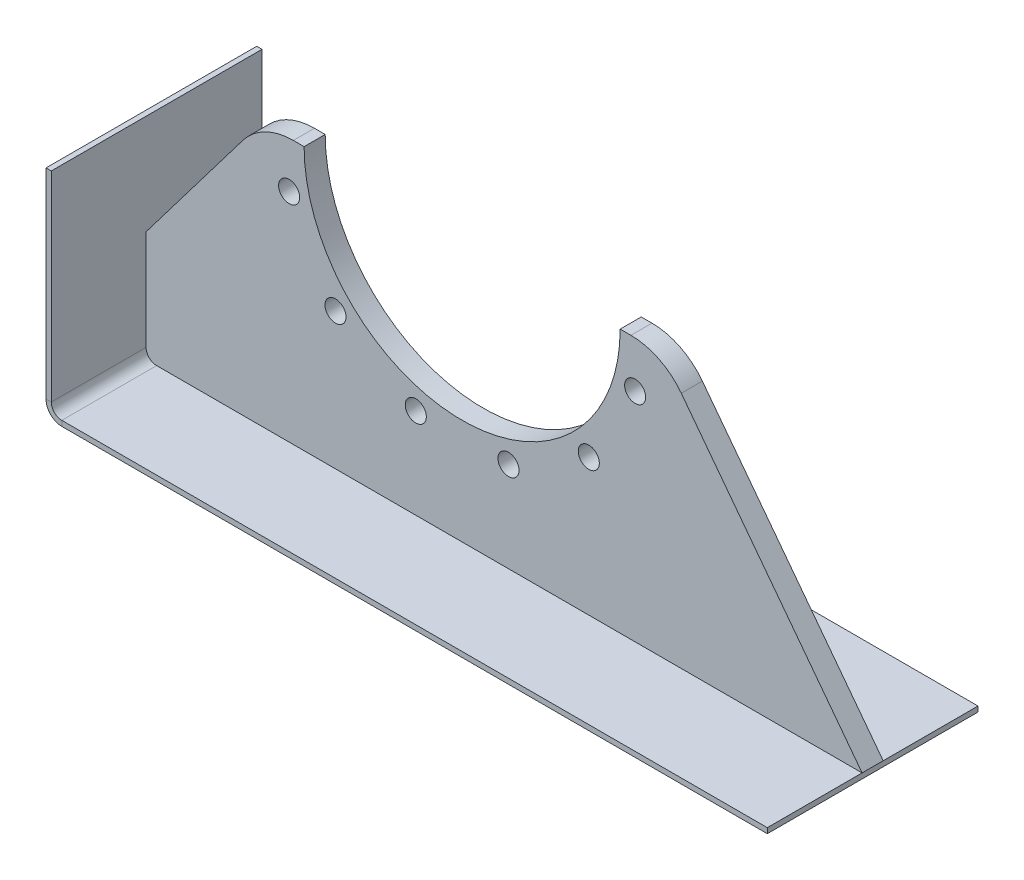
ISO-10303-21;
HEADER;
FILE_DESCRIPTION(('STEP AP214'),'2;1');
FILE_NAME('part.step','',(''),(''),'','','');
FILE_SCHEMA(('AUTOMOTIVE_DESIGN { 1 0 10303 214 1 1 1 1 }'));
ENDSEC;
DATA;
#1=APPLICATION_CONTEXT('core data for automotive mechanical design processes');
#2=APPLICATION_PROTOCOL_DEFINITION('international standard','automotive_design',2000,#1);
#3=PRODUCT_CONTEXT('',#1,'mechanical');
#4=PRODUCT('Part','Part','',(#3));
#5=PRODUCT_RELATED_PRODUCT_CATEGORY('part','',(#4));
#6=PRODUCT_DEFINITION_FORMATION('','',#4);
#7=PRODUCT_DEFINITION_CONTEXT('part definition',#1,'design');
#8=PRODUCT_DEFINITION('design','',#6,#7);
#9=PRODUCT_DEFINITION_SHAPE('','',#8);
#10=(LENGTH_UNIT() NAMED_UNIT(*) SI_UNIT(.MILLI.,.METRE.));
#11=(NAMED_UNIT(*) PLANE_ANGLE_UNIT() SI_UNIT($,.RADIAN.));
#12=(NAMED_UNIT(*) SI_UNIT($,.STERADIAN.) SOLID_ANGLE_UNIT());
#13=UNCERTAINTY_MEASURE_WITH_UNIT(LENGTH_MEASURE(1.E-05),#10,'distance_accuracy_value','');
#14=(GEOMETRIC_REPRESENTATION_CONTEXT(3) GLOBAL_UNCERTAINTY_ASSIGNED_CONTEXT((#13)) GLOBAL_UNIT_ASSIGNED_CONTEXT((#10,
#11,#12)) REPRESENTATION_CONTEXT('',''));
#15=CARTESIAN_POINT('',(0.,0.,0.));
#16=DIRECTION('',(0.,0.,1.));
#17=DIRECTION('',(1.,0.,0.));
#18=AXIS2_PLACEMENT_3D('',#15,#16,#17);
#19=CARTESIAN_POINT('',(482.162068965513,-317.5,-127.));
#20=DIRECTION('',(-1.,0.,0.));
#21=DIRECTION('',(0.,0.,1.));
#22=AXIS2_PLACEMENT_3D('',#19,#20,#21);
#23=PLANE('',#22);
#24=DIRECTION('',(0.,1.,0.));
#25=VECTOR('',#24,1.);
#26=CARTESIAN_POINT('',(482.162068965513,-317.5,127.));
#27=LINE('',#26,#25);
#28=CARTESIAN_POINT('',(482.162068965514,-323.85,127.));
#29=VERTEX_POINT('',#28);
#30=CARTESIAN_POINT('',(482.162068965513,-317.5,127.));
#31=VERTEX_POINT('',#30);
#32=EDGE_CURVE('E12',#29,#31,#27,.T.);
#33=ORIENTED_EDGE('',*,*,#32,.F.);
#34=DIRECTION('',(0.,0.,1.));
#35=VECTOR('',#34,1.);
#36=CARTESIAN_POINT('',(482.162068965514,-323.85,-127.));
#37=LINE('',#36,#35);
#38=CARTESIAN_POINT('',(482.162068965514,-323.85,-127.));
#39=VERTEX_POINT('',#38);
#40=EDGE_CURVE('E144',#39,#29,#37,.T.);
#41=ORIENTED_EDGE('',*,*,#40,.F.);
#42=DIRECTION('',(0.,1.,0.));
#43=VECTOR('',#42,1.);
#44=CARTESIAN_POINT('',(482.162068965513,-317.5,-127.));
#45=LINE('',#44,#43);
#46=CARTESIAN_POINT('',(482.162068965513,-317.5,-127.));
#47=VERTEX_POINT('',#46);
#48=EDGE_CURVE('E72',#39,#47,#45,.T.);
#49=ORIENTED_EDGE('',*,*,#48,.T.);
#50=DIRECTION('',(0.,0.,1.));
#51=VECTOR('',#50,1.);
#52=CARTESIAN_POINT('',(482.162068965513,-317.5,-127.));
#53=LINE('',#52,#51);
#54=EDGE_CURVE('E178',#47,#31,#53,.T.);
#55=ORIENTED_EDGE('',*,*,#54,.T.);
#56=EDGE_LOOP('',(#33,#41,#49,#55));
#57=FACE_BOUND('',#56,.T.);
#58=ADVANCED_FACE('F62',(#57),#23,.F.);
#59=CARTESIAN_POINT('',(-368.3,-317.5,-127.));
#60=DIRECTION('',(0.,0.,-1.));
#61=DIRECTION('',(-1.,0.,0.));
#62=AXIS2_PLACEMENT_3D('',#59,#60,#61);
#63=PLANE('',#62);
#64=ORIENTED_EDGE('',*,*,#48,.F.);
#65=DIRECTION('',(1.,0.,0.));
#66=VECTOR('',#65,1.);
#67=CARTESIAN_POINT('',(-368.3,-323.85,-127.));
#68=LINE('',#67,#66);
#69=CARTESIAN_POINT('',(-368.3,-323.85,-127.));
#70=VERTEX_POINT('',#69);
#71=EDGE_CURVE('E149',#39,#70,#68,.F.);
#72=ORIENTED_EDGE('',*,*,#71,.T.);
#73=DIRECTION('',(0.,1.,0.));
#74=VECTOR('',#73,1.);
#75=CARTESIAN_POINT('',(-368.3,-317.5,-127.));
#76=LINE('',#75,#74);
#77=CARTESIAN_POINT('',(-368.3,-317.5,-127.));
#78=VERTEX_POINT('',#77);
#79=EDGE_CURVE('E80',#70,#78,#76,.T.);
#80=ORIENTED_EDGE('',*,*,#79,.T.);
#81=DIRECTION('',(-1.,0.,0.));
#82=VECTOR('',#81,1.);
#83=CARTESIAN_POINT('',(-368.3,-317.5,-127.));
#84=LINE('',#83,#82);
#85=EDGE_CURVE('E181',#47,#78,#84,.T.);
#86=ORIENTED_EDGE('',*,*,#85,.F.);
#87=EDGE_LOOP('',(#64,#72,#80,#86));
#88=FACE_BOUND('',#87,.T.);
#89=ADVANCED_FACE('F184',(#88),#63,.T.);
#90=CARTESIAN_POINT('',(-368.3,-304.8,-127.));
#91=DIRECTION('',(0.,0.,1.));
#92=DIRECTION('',(1.,0.,0.));
#93=AXIS2_PLACEMENT_3D('',#90,#91,#92);
#94=PLANE('',#93);
#95=ORIENTED_EDGE('',*,*,#79,.F.);
#96=CARTESIAN_POINT('',(-368.3,-304.8,-127.));
#97=DIRECTION('',(0.,0.,1.));
#98=DIRECTION('',(1.,0.,0.));
#99=AXIS2_PLACEMENT_3D('',#96,#97,#98);
#100=CIRCLE('',#99,19.05);
#101=CARTESIAN_POINT('',(-387.35,-304.8,-127.));
#102=VERTEX_POINT('',#101);
#103=EDGE_CURVE('E138',#70,#102,#100,.F.);
#104=ORIENTED_EDGE('',*,*,#103,.T.);
#105=DIRECTION('',(1.,0.,0.));
#106=VECTOR('',#105,1.);
#107=CARTESIAN_POINT('',(-381.,-304.8,-127.));
#108=LINE('',#107,#106);
#109=CARTESIAN_POINT('',(-381.,-304.8,-127.));
#110=VERTEX_POINT('',#109);
#111=EDGE_CURVE('E173',#102,#110,#108,.T.);
#112=ORIENTED_EDGE('',*,*,#111,.T.);
#113=CARTESIAN_POINT('',(-368.3,-304.8,-127.));
#114=DIRECTION('',(0.,0.,-1.));
#115=DIRECTION('',(1.,0.,0.));
#116=AXIS2_PLACEMENT_3D('',#113,#114,#115);
#117=CIRCLE('',#116,12.7);
#118=EDGE_CURVE('E127',#78,#110,#117,.T.);
#119=ORIENTED_EDGE('',*,*,#118,.F.);
#120=EDGE_LOOP('',(#95,#104,#112,#119));
#121=FACE_BOUND('',#120,.T.);
#122=ADVANCED_FACE('F197',(#121),#94,.F.);
#123=CARTESIAN_POINT('',(-381.,-63.5,-127.));
#124=DIRECTION('',(0.,0.,-1.));
#125=DIRECTION('',(0.,1.,0.));
#126=AXIS2_PLACEMENT_3D('',#123,#124,#125);
#127=PLANE('',#126);
#128=ORIENTED_EDGE('',*,*,#111,.F.);
#129=DIRECTION('',(0.,1.,0.));
#130=VECTOR('',#129,1.);
#131=CARTESIAN_POINT('',(-387.35,-63.5,-127.));
#132=LINE('',#131,#130);
#133=CARTESIAN_POINT('',(-387.35,-63.5,-127.));
#134=VERTEX_POINT('',#133);
#135=EDGE_CURVE('E141',#102,#134,#132,.T.);
#136=ORIENTED_EDGE('',*,*,#135,.T.);
#137=DIRECTION('',(1.,0.,0.));
#138=VECTOR('',#137,1.);
#139=CARTESIAN_POINT('',(-381.,-63.5,-127.));
#140=LINE('',#139,#138);
#141=CARTESIAN_POINT('',(-381.,-63.5,-127.));
#142=VERTEX_POINT('',#141);
#143=EDGE_CURVE('E170',#134,#142,#140,.T.);
#144=ORIENTED_EDGE('',*,*,#143,.T.);
#145=DIRECTION('',(0.,1.,0.));
#146=VECTOR('',#145,1.);
#147=CARTESIAN_POINT('',(-381.,-63.5,-127.));
#148=LINE('',#147,#146);
#149=EDGE_CURVE('E206',#110,#142,#148,.T.);
#150=ORIENTED_EDGE('',*,*,#149,.F.);
#151=EDGE_LOOP('',(#128,#136,#144,#150));
#152=FACE_BOUND('',#151,.T.);
#153=ADVANCED_FACE('F231',(#152),#127,.T.);
#154=CARTESIAN_POINT('',(-381.,-63.5,-127.));
#155=DIRECTION('',(0.,1.,0.));
#156=DIRECTION('',(0.,0.,1.));
#157=AXIS2_PLACEMENT_3D('',#154,#155,#156);
#158=PLANE('',#157);
#159=ORIENTED_EDGE('',*,*,#143,.F.);
#160=DIRECTION('',(0.,0.,1.));
#161=VECTOR('',#160,1.);
#162=CARTESIAN_POINT('',(-387.35,-63.5,-127.));
#163=LINE('',#162,#161);
#164=CARTESIAN_POINT('',(-387.35,-63.5,127.));
#165=VERTEX_POINT('',#164);
#166=EDGE_CURVE('E160',#134,#165,#163,.T.);
#167=ORIENTED_EDGE('',*,*,#166,.T.);
#168=DIRECTION('',(1.,0.,0.));
#169=VECTOR('',#168,1.);
#170=CARTESIAN_POINT('',(-381.,-63.5,127.));
#171=LINE('',#170,#169);
#172=CARTESIAN_POINT('',(-381.,-63.5,127.));
#173=VERTEX_POINT('',#172);
#174=EDGE_CURVE('E167',#165,#173,#171,.T.);
#175=ORIENTED_EDGE('',*,*,#174,.T.);
#176=DIRECTION('',(0.,0.,1.));
#177=VECTOR('',#176,1.);
#178=CARTESIAN_POINT('',(-381.,-63.5,-127.));
#179=LINE('',#178,#177);
#180=EDGE_CURVE('E151',#142,#173,#179,.T.);
#181=ORIENTED_EDGE('',*,*,#180,.F.);
#182=EDGE_LOOP('',(#159,#167,#175,#181));
#183=FACE_BOUND('',#182,.T.);
#184=ADVANCED_FACE('F232',(#183),#158,.T.);
#185=CARTESIAN_POINT('',(-381.,-63.5,127.));
#186=DIRECTION('',(0.,0.,-1.));
#187=DIRECTION('',(0.,1.,0.));
#188=AXIS2_PLACEMENT_3D('',#185,#186,#187);
#189=PLANE('',#188);
#190=ORIENTED_EDGE('',*,*,#174,.F.);
#191=DIRECTION('',(0.,1.,0.));
#192=VECTOR('',#191,1.);
#193=CARTESIAN_POINT('',(-387.35,-63.5,127.));
#194=LINE('',#193,#192);
#195=CARTESIAN_POINT('',(-387.35,-304.8,127.));
#196=VERTEX_POINT('',#195);
#197=EDGE_CURVE('E156',#196,#165,#194,.T.);
#198=ORIENTED_EDGE('',*,*,#197,.F.);
#199=DIRECTION('',(1.,0.,0.));
#200=VECTOR('',#199,1.);
#201=CARTESIAN_POINT('',(-381.,-304.8,127.));
#202=LINE('',#201,#200);
#203=CARTESIAN_POINT('',(-381.,-304.8,127.));
#204=VERTEX_POINT('',#203);
#205=EDGE_CURVE('E126',#196,#204,#202,.T.);
#206=ORIENTED_EDGE('',*,*,#205,.T.);
#207=DIRECTION('',(0.,1.,0.));
#208=VECTOR('',#207,1.);
#209=CARTESIAN_POINT('',(-381.,-63.5,127.));
#210=LINE('',#209,#208);
#211=EDGE_CURVE('E213',#204,#173,#210,.T.);
#212=ORIENTED_EDGE('',*,*,#211,.T.);
#213=EDGE_LOOP('',(#190,#198,#206,#212));
#214=FACE_BOUND('',#213,.T.);
#215=ADVANCED_FACE('F226',(#214),#189,.F.);
#216=CARTESIAN_POINT('',(-368.3,-304.8,127.));
#217=DIRECTION('',(0.,0.,1.));
#218=DIRECTION('',(1.,0.,0.));
#219=AXIS2_PLACEMENT_3D('',#216,#217,#218);
#220=PLANE('',#219);
#221=ORIENTED_EDGE('',*,*,#205,.F.);
#222=CARTESIAN_POINT('',(-368.3,-304.8,127.));
#223=DIRECTION('',(0.,0.,1.));
#224=DIRECTION('',(1.,0.,0.));
#225=AXIS2_PLACEMENT_3D('',#222,#223,#224);
#226=CIRCLE('',#225,19.05);
#227=CARTESIAN_POINT('',(-368.3,-323.85,127.));
#228=VERTEX_POINT('',#227);
#229=EDGE_CURVE('E135',#228,#196,#226,.F.);
#230=ORIENTED_EDGE('',*,*,#229,.F.);
#231=DIRECTION('',(0.,1.,0.));
#232=VECTOR('',#231,1.);
#233=CARTESIAN_POINT('',(-368.3,-317.5,127.));
#234=LINE('',#233,#232);
#235=CARTESIAN_POINT('',(-368.3,-317.5,127.));
#236=VERTEX_POINT('',#235);
#237=EDGE_CURVE('E66',#228,#236,#234,.T.);
#238=ORIENTED_EDGE('',*,*,#237,.T.);
#239=CARTESIAN_POINT('',(-368.3,-304.8,127.));
#240=DIRECTION('',(0.,0.,-1.));
#241=DIRECTION('',(1.,0.,0.));
#242=AXIS2_PLACEMENT_3D('',#239,#240,#241);
#243=CIRCLE('',#242,12.7);
#244=EDGE_CURVE('E185',#236,#204,#243,.T.);
#245=ORIENTED_EDGE('',*,*,#244,.T.);
#246=EDGE_LOOP('',(#221,#230,#238,#245));
#247=FACE_BOUND('',#246,.T.);
#248=ADVANCED_FACE('F146',(#247),#220,.T.);
#249=CARTESIAN_POINT('',(-368.3,-317.5,127.));
#250=DIRECTION('',(0.,0.,-1.));
#251=DIRECTION('',(-1.,0.,0.));
#252=AXIS2_PLACEMENT_3D('',#249,#250,#251);
#253=PLANE('',#252);
#254=DIRECTION('',(1.,0.,0.));
#255=VECTOR('',#254,1.);
#256=CARTESIAN_POINT('',(-368.3,-323.85,127.));
#257=LINE('',#256,#255);
#258=EDGE_CURVE('E117',#29,#228,#257,.F.);
#259=ORIENTED_EDGE('',*,*,#258,.F.);
#260=ORIENTED_EDGE('',*,*,#32,.T.);
#261=DIRECTION('',(-1.,0.,0.));
#262=VECTOR('',#261,1.);
#263=CARTESIAN_POINT('',(-368.3,-317.5,127.));
#264=LINE('',#263,#262);
#265=EDGE_CURVE('E120',#31,#236,#264,.T.);
#266=ORIENTED_EDGE('',*,*,#265,.T.);
#267=ORIENTED_EDGE('',*,*,#237,.F.);
#268=EDGE_LOOP('',(#259,#260,#266,#267));
#269=FACE_BOUND('',#268,.T.);
#270=ADVANCED_FACE('F64',(#269),#253,.F.);
#271=CARTESIAN_POINT('',(-368.3,-304.8,-127.));
#272=DIRECTION('',(0.,0.,1.));
#273=DIRECTION('',(1.,0.,0.));
#274=AXIS2_PLACEMENT_3D('',#271,#272,#273);
#275=CYLINDRICAL_SURFACE('',#274,12.7);
#276=DIRECTION('',(0.,0.,1.));
#277=VECTOR('',#276,1.);
#278=CARTESIAN_POINT('',(-381.,-304.8,-127.));
#279=LINE('',#278,#277);
#280=EDGE_CURVE('E209',#110,#204,#279,.T.);
#281=ORIENTED_EDGE('',*,*,#280,.T.);
#282=ORIENTED_EDGE('',*,*,#244,.F.);
#283=DIRECTION('',(0.,0.,1.));
#284=VECTOR('',#283,1.);
#285=CARTESIAN_POINT('',(-368.3,-317.5,-127.));
#286=LINE('',#285,#284);
#287=EDGE_CURVE('E204',#78,#236,#286,.T.);
#288=ORIENTED_EDGE('',*,*,#287,.F.);
#289=ORIENTED_EDGE('',*,*,#118,.T.);
#290=EDGE_LOOP('',(#281,#282,#288,#289));
#291=FACE_BOUND('',#290,.T.);
#292=ADVANCED_FACE('F205',(#291),#275,.F.);
#293=CARTESIAN_POINT('',(-368.3,-317.5,-127.));
#294=DIRECTION('',(0.,1.,0.));
#295=DIRECTION('',(0.,0.,1.));
#296=AXIS2_PLACEMENT_3D('',#293,#294,#295);
#297=PLANE('',#296);
#298=ORIENTED_EDGE('',*,*,#287,.T.);
#299=ORIENTED_EDGE('',*,*,#265,.F.);
#300=ORIENTED_EDGE('',*,*,#54,.F.);
#301=ORIENTED_EDGE('',*,*,#85,.T.);
#302=EDGE_LOOP('',(#298,#299,#300,#301));
#303=FACE_BOUND('',#302,.T.);
#304=ADVANCED_FACE('F180',(#303),#297,.T.);
#305=CARTESIAN_POINT('',(-381.,-63.5,-127.));
#306=DIRECTION('',(1.,0.,0.));
#307=DIRECTION('',(0.,1.,0.));
#308=AXIS2_PLACEMENT_3D('',#305,#306,#307);
#309=PLANE('',#308);
#310=ORIENTED_EDGE('',*,*,#180,.T.);
#311=ORIENTED_EDGE('',*,*,#211,.F.);
#312=ORIENTED_EDGE('',*,*,#280,.F.);
#313=ORIENTED_EDGE('',*,*,#149,.T.);
#314=EDGE_LOOP('',(#310,#311,#312,#313));
#315=FACE_BOUND('',#314,.T.);
#316=ADVANCED_FACE('F220',(#315),#309,.T.);
#317=CARTESIAN_POINT('',(-368.3,-304.8,-127.));
#318=DIRECTION('',(0.,0.,1.));
#319=DIRECTION('',(1.,0.,0.));
#320=AXIS2_PLACEMENT_3D('',#317,#318,#319);
#321=CYLINDRICAL_SURFACE('',#320,19.05);
#322=DIRECTION('',(0.,0.,1.));
#323=VECTOR('',#322,1.);
#324=CARTESIAN_POINT('',(-387.35,-304.8,-127.));
#325=LINE('',#324,#323);
#326=EDGE_CURVE('E159',#102,#196,#325,.T.);
#327=ORIENTED_EDGE('',*,*,#326,.F.);
#328=ORIENTED_EDGE('',*,*,#103,.F.);
#329=DIRECTION('',(0.,0.,1.));
#330=VECTOR('',#329,1.);
#331=CARTESIAN_POINT('',(-368.3,-323.85,-127.));
#332=LINE('',#331,#330);
#333=EDGE_CURVE('E132',#70,#228,#332,.T.);
#334=ORIENTED_EDGE('',*,*,#333,.T.);
#335=ORIENTED_EDGE('',*,*,#229,.T.);
#336=EDGE_LOOP('',(#327,#328,#334,#335));
#337=FACE_BOUND('',#336,.T.);
#338=ADVANCED_FACE('F134',(#337),#321,.T.);
#339=CARTESIAN_POINT('',(-368.3,-323.85,-127.));
#340=DIRECTION('',(0.,1.,0.));
#341=DIRECTION('',(0.,0.,1.));
#342=AXIS2_PLACEMENT_3D('',#339,#340,#341);
#343=PLANE('',#342);
#344=ORIENTED_EDGE('',*,*,#333,.F.);
#345=ORIENTED_EDGE('',*,*,#71,.F.);
#346=ORIENTED_EDGE('',*,*,#40,.T.);
#347=ORIENTED_EDGE('',*,*,#258,.T.);
#348=EDGE_LOOP('',(#344,#345,#346,#347));
#349=FACE_BOUND('',#348,.T.);
#350=ADVANCED_FACE('F143',(#349),#343,.F.);
#351=CARTESIAN_POINT('',(-387.35,-63.5,-127.));
#352=DIRECTION('',(1.,0.,0.));
#353=DIRECTION('',(0.,1.,0.));
#354=AXIS2_PLACEMENT_3D('',#351,#352,#353);
#355=PLANE('',#354);
#356=ORIENTED_EDGE('',*,*,#166,.F.);
#357=ORIENTED_EDGE('',*,*,#135,.F.);
#358=ORIENTED_EDGE('',*,*,#326,.T.);
#359=ORIENTED_EDGE('',*,*,#197,.T.);
#360=EDGE_LOOP('',(#356,#357,#358,#359));
#361=FACE_BOUND('',#360,.T.);
#362=ADVANCED_FACE('F194',(#361),#355,.F.);
#363=CLOSED_SHELL('',(#58,#89,#122,#153,#184,#215,#248,#270,#292,#304,#316,#338,#350,#362));
#364=MANIFOLD_SOLID_BREP('B2',#363);
#365=CARTESIAN_POINT('',(0.,0.,-12.7));
#366=DIRECTION('',(0.,-1.,0.));
#367=DIRECTION('',(1.,0.,0.));
#368=AXIS2_PLACEMENT_3D('',#365,#366,#367);
#369=PLANE('',#368);
#370=DIRECTION('',(0.,0.,-1.));
#371=VECTOR('',#370,1.);
#372=CARTESIAN_POINT('',(-203.461314902901,0.,-12.7));
#373=LINE('',#372,#371);
#374=CARTESIAN_POINT('',(-203.461314902901,0.,12.7));
#375=VERTEX_POINT('',#374);
#376=CARTESIAN_POINT('',(-203.461314902901,0.,-12.7));
#377=VERTEX_POINT('',#376);
#378=EDGE_CURVE('E60',#375,#377,#373,.T.);
#379=ORIENTED_EDGE('',*,*,#378,.F.);
#380=DIRECTION('',(1.,0.,0.));
#381=VECTOR('',#380,1.);
#382=CARTESIAN_POINT('',(0.,0.,12.7));
#383=LINE('',#382,#381);
#384=CARTESIAN_POINT('',(-190.5,0.,12.7));
#385=VERTEX_POINT('',#384);
#386=EDGE_CURVE('E473',#375,#385,#383,.T.);
#387=ORIENTED_EDGE('',*,*,#386,.T.);
#388=DIRECTION('',(0.,0.,-1.));
#389=VECTOR('',#388,1.);
#390=CARTESIAN_POINT('',(-190.5,0.,-12.7));
#391=LINE('',#390,#389);
#392=CARTESIAN_POINT('',(-190.5,0.,-12.7));
#393=VERTEX_POINT('',#392);
#394=EDGE_CURVE('E408',#385,#393,#391,.T.);
#395=ORIENTED_EDGE('',*,*,#394,.T.);
#396=DIRECTION('',(1.,0.,0.));
#397=VECTOR('',#396,1.);
#398=CARTESIAN_POINT('',(0.,0.,-12.7));
#399=LINE('',#398,#397);
#400=EDGE_CURVE('E564',#377,#393,#399,.T.);
#401=ORIENTED_EDGE('',*,*,#400,.F.);
#402=EDGE_LOOP('',(#379,#387,#395,#401));
#403=FACE_BOUND('',#402,.T.);
#404=ADVANCED_FACE('F398',(#403),#369,.F.);
#405=CARTESIAN_POINT('',(0.,0.,-12.7));
#406=DIRECTION('',(0.,0.,1.));
#407=DIRECTION('',(1.,0.,0.));
#408=AXIS2_PLACEMENT_3D('',#405,#406,#407);
#409=CYLINDRICAL_SURFACE('',#408,190.5);
#410=ORIENTED_EDGE('',*,*,#394,.F.);
#411=CARTESIAN_POINT('',(0.,0.,12.7));
#412=DIRECTION('',(0.,0.,1.));
#413=DIRECTION('',(1.,0.,0.));
#414=AXIS2_PLACEMENT_3D('',#411,#412,#413);
#415=CIRCLE('',#414,190.5);
#416=CARTESIAN_POINT('',(190.5,0.,12.7));
#417=VERTEX_POINT('',#416);
#418=EDGE_CURVE('E628',#385,#417,#415,.T.);
#419=ORIENTED_EDGE('',*,*,#418,.T.);
#420=DIRECTION('',(0.,0.,-1.));
#421=VECTOR('',#420,1.);
#422=CARTESIAN_POINT('',(190.5,0.,-12.7));
#423=LINE('',#422,#421);
#424=CARTESIAN_POINT('',(190.5,0.,-12.7));
#425=VERTEX_POINT('',#424);
#426=EDGE_CURVE('E557',#417,#425,#423,.T.);
#427=ORIENTED_EDGE('',*,*,#426,.T.);
#428=CARTESIAN_POINT('',(0.,0.,-12.7));
#429=DIRECTION('',(0.,0.,1.));
#430=DIRECTION('',(1.,0.,0.));
#431=AXIS2_PLACEMENT_3D('',#428,#429,#430);
#432=CIRCLE('',#431,190.5);
#433=EDGE_CURVE('E574',#393,#425,#432,.T.);
#434=ORIENTED_EDGE('',*,*,#433,.F.);
#435=EDGE_LOOP('',(#410,#419,#427,#434));
#436=FACE_BOUND('',#435,.T.);
#437=ADVANCED_FACE('F577',(#436),#409,.F.);
#438=CARTESIAN_POINT('',(0.,0.,-12.7));
#439=DIRECTION('',(0.,-1.,0.));
#440=DIRECTION('',(1.,0.,0.));
#441=AXIS2_PLACEMENT_3D('',#438,#439,#440);
#442=PLANE('',#441);
#443=ORIENTED_EDGE('',*,*,#426,.F.);
#444=DIRECTION('',(1.,0.,0.));
#445=VECTOR('',#444,1.);
#446=CARTESIAN_POINT('',(0.,0.,12.7));
#447=LINE('',#446,#445);
#448=CARTESIAN_POINT('',(203.4613149029,0.,12.7));
#449=VERTEX_POINT('',#448);
#450=EDGE_CURVE('E626',#417,#449,#447,.T.);
#451=ORIENTED_EDGE('',*,*,#450,.T.);
#452=DIRECTION('',(0.,0.,-1.));
#453=VECTOR('',#452,1.);
#454=CARTESIAN_POINT('',(203.4613149029,0.,-12.7));
#455=LINE('',#454,#453);
#456=CARTESIAN_POINT('',(203.4613149029,0.,-12.7));
#457=VERTEX_POINT('',#456);
#458=EDGE_CURVE('E554',#449,#457,#455,.T.);
#459=ORIENTED_EDGE('',*,*,#458,.T.);
#460=DIRECTION('',(1.,0.,0.));
#461=VECTOR('',#460,1.);
#462=CARTESIAN_POINT('',(0.,0.,-12.7));
#463=LINE('',#462,#461);
#464=EDGE_CURVE('E578',#425,#457,#463,.T.);
#465=ORIENTED_EDGE('',*,*,#464,.F.);
#466=EDGE_LOOP('',(#443,#451,#459,#465));
#467=FACE_BOUND('',#466,.T.);
#468=ADVANCED_FACE('F624',(#467),#442,.F.);
#469=CARTESIAN_POINT('',(203.4613149029,-76.2,-12.7));
#470=DIRECTION('',(0.,0.,1.));
#471=DIRECTION('',(1.,0.,0.));
#472=AXIS2_PLACEMENT_3D('',#469,#470,#471);
#473=CYLINDRICAL_SURFACE('',#472,76.2);
#474=ORIENTED_EDGE('',*,*,#458,.F.);
#475=CARTESIAN_POINT('',(203.4613149029,-76.2,12.7));
#476=DIRECTION('',(0.,0.,1.));
#477=DIRECTION('',(1.,0.,0.));
#478=AXIS2_PLACEMENT_3D('',#475,#476,#477);
#479=CIRCLE('',#478,76.2);
#480=CARTESIAN_POINT('',(264.169189745663,-30.145750119284,12.7));
#481=VERTEX_POINT('',#480);
#482=EDGE_CURVE('E627',#449,#481,#479,.F.);
#483=ORIENTED_EDGE('',*,*,#482,.T.);
#484=DIRECTION('',(0.,0.,-1.));
#485=VECTOR('',#484,1.);
#486=CARTESIAN_POINT('',(264.169189745663,-30.145750119284,-12.7));
#487=LINE('',#486,#485);
#488=CARTESIAN_POINT('',(264.169189745663,-30.145750119284,-12.7));
#489=VERTEX_POINT('',#488);
#490=EDGE_CURVE('E551',#481,#489,#487,.T.);
#491=ORIENTED_EDGE('',*,*,#490,.T.);
#492=CARTESIAN_POINT('',(203.4613149029,-76.2,-12.7));
#493=DIRECTION('',(0.,0.,1.));
#494=DIRECTION('',(1.,0.,0.));
#495=AXIS2_PLACEMENT_3D('',#492,#493,#494);
#496=CIRCLE('',#495,76.2);
#497=EDGE_CURVE('E580',#457,#489,#496,.F.);
#498=ORIENTED_EDGE('',*,*,#497,.F.);
#499=EDGE_LOOP('',(#474,#483,#491,#498));
#500=FACE_BOUND('',#499,.T.);
#501=ADVANCED_FACE('F615',(#500),#473,.T.);
#502=CARTESIAN_POINT('',(153.157207547172,116.188226415094,-12.7));
#503=DIRECTION('',(-0.796691270902401,-0.604386481374226,0.));
#504=DIRECTION('',(0.604386481374226,-0.796691270902401,0.));
#505=AXIS2_PLACEMENT_3D('',#502,#503,#504);
#506=PLANE('',#505);
#507=ORIENTED_EDGE('',*,*,#490,.F.);
#508=DIRECTION('',(0.604386481374226,-0.796691270902401,0.));
#509=VECTOR('',#508,1.);
#510=CARTESIAN_POINT('',(153.157207547172,116.188226415094,12.7));
#511=LINE('',#510,#509);
#512=CARTESIAN_POINT('',(482.162068965513,-317.5,12.7));
#513=VERTEX_POINT('',#512);
#514=EDGE_CURVE('E493',#481,#513,#511,.T.);
#515=ORIENTED_EDGE('',*,*,#514,.T.);
#516=DIRECTION('',(0.,0.,-1.));
#517=VECTOR('',#516,1.);
#518=CARTESIAN_POINT('',(482.162068965513,-317.5,-12.7));
#519=LINE('',#518,#517);
#520=CARTESIAN_POINT('',(482.162068965513,-317.5,-12.7));
#521=VERTEX_POINT('',#520);
#522=EDGE_CURVE('E548',#513,#521,#519,.T.);
#523=ORIENTED_EDGE('',*,*,#522,.T.);
#524=DIRECTION('',(0.604386481374226,-0.796691270902401,0.));
#525=VECTOR('',#524,1.);
#526=CARTESIAN_POINT('',(153.157207547172,116.188226415094,-12.7));
#527=LINE('',#526,#525);
#528=EDGE_CURVE('E586',#489,#521,#527,.T.);
#529=ORIENTED_EDGE('',*,*,#528,.F.);
#530=EDGE_LOOP('',(#507,#515,#523,#529));
#531=FACE_BOUND('',#530,.T.);
#532=ADVANCED_FACE('F608',(#531),#506,.F.);
#533=CARTESIAN_POINT('',(0.,-317.5,-12.7));
#534=DIRECTION('',(0.,-1.,0.));
#535=DIRECTION('',(1.,0.,0.));
#536=AXIS2_PLACEMENT_3D('',#533,#534,#535);
#537=PLANE('',#536);
#538=ORIENTED_EDGE('',*,*,#522,.F.);
#539=DIRECTION('',(1.,0.,0.));
#540=VECTOR('',#539,1.);
#541=CARTESIAN_POINT('',(0.,-317.5,12.7));
#542=LINE('',#541,#540);
#543=CARTESIAN_POINT('',(-368.3,-317.5,12.7));
#544=VERTEX_POINT('',#543);
#545=EDGE_CURVE('E488',#544,#513,#542,.T.);
#546=ORIENTED_EDGE('',*,*,#545,.F.);
#547=DIRECTION('',(0.,0.,-1.));
#548=VECTOR('',#547,1.);
#549=CARTESIAN_POINT('',(-368.3,-317.5,-12.7));
#550=LINE('',#549,#548);
#551=CARTESIAN_POINT('',(-368.3,-317.5,-12.7));
#552=VERTEX_POINT('',#551);
#553=EDGE_CURVE('E545',#544,#552,#550,.T.);
#554=ORIENTED_EDGE('',*,*,#553,.T.);
#555=DIRECTION('',(1.,0.,0.));
#556=VECTOR('',#555,1.);
#557=CARTESIAN_POINT('',(0.,-317.5,-12.7));
#558=LINE('',#557,#556);
#559=EDGE_CURVE('E588',#552,#521,#558,.T.);
#560=ORIENTED_EDGE('',*,*,#559,.T.);
#561=EDGE_LOOP('',(#538,#546,#554,#560));
#562=FACE_BOUND('',#561,.T.);
#563=ADVANCED_FACE('F605',(#562),#537,.T.);
#564=CARTESIAN_POINT('',(-368.3,-304.8,-12.7));
#565=DIRECTION('',(0.,0.,1.));
#566=DIRECTION('',(1.,0.,0.));
#567=AXIS2_PLACEMENT_3D('',#564,#565,#566);
#568=CYLINDRICAL_SURFACE('',#567,12.7);
#569=ORIENTED_EDGE('',*,*,#553,.F.);
#570=CARTESIAN_POINT('',(-368.3,-304.8,12.7));
#571=DIRECTION('',(0.,0.,1.));
#572=DIRECTION('',(1.,0.,0.));
#573=AXIS2_PLACEMENT_3D('',#570,#571,#572);
#574=CIRCLE('',#573,12.7);
#575=CARTESIAN_POINT('',(-381.,-304.8,12.7));
#576=VERTEX_POINT('',#575);
#577=EDGE_CURVE('E484',#544,#576,#574,.F.);
#578=ORIENTED_EDGE('',*,*,#577,.T.);
#579=DIRECTION('',(0.,0.,-1.));
#580=VECTOR('',#579,1.);
#581=CARTESIAN_POINT('',(-381.,-304.8,-12.7));
#582=LINE('',#581,#580);
#583=CARTESIAN_POINT('',(-381.,-304.8,-12.7));
#584=VERTEX_POINT('',#583);
#585=EDGE_CURVE('E543',#576,#584,#582,.T.);
#586=ORIENTED_EDGE('',*,*,#585,.T.);
#587=CARTESIAN_POINT('',(-368.3,-304.8,-12.7));
#588=DIRECTION('',(0.,0.,1.));
#589=DIRECTION('',(1.,0.,0.));
#590=AXIS2_PLACEMENT_3D('',#587,#588,#589);
#591=CIRCLE('',#590,12.7);
#592=EDGE_CURVE('E506',#552,#584,#591,.F.);
#593=ORIENTED_EDGE('',*,*,#592,.F.);
#594=EDGE_LOOP('',(#569,#578,#586,#593));
#595=FACE_BOUND('',#594,.T.);
#596=ADVANCED_FACE('F601',(#595),#568,.T.);
#597=CARTESIAN_POINT('',(-381.,0.,-12.7));
#598=DIRECTION('',(1.,0.,0.));
#599=DIRECTION('',(0.,1.,0.));
#600=AXIS2_PLACEMENT_3D('',#597,#598,#599);
#601=PLANE('',#600);
#602=ORIENTED_EDGE('',*,*,#585,.F.);
#603=DIRECTION('',(0.,1.,0.));
#604=VECTOR('',#603,1.);
#605=CARTESIAN_POINT('',(-381.,0.,12.7));
#606=LINE('',#605,#604);
#607=CARTESIAN_POINT('',(-381.,-184.15,12.7));
#608=VERTEX_POINT('',#607);
#609=EDGE_CURVE('E479',#576,#608,#606,.T.);
#610=ORIENTED_EDGE('',*,*,#609,.T.);
#611=DIRECTION('',(0.,0.,-1.));
#612=VECTOR('',#611,1.);
#613=CARTESIAN_POINT('',(-381.,-184.15,-12.7));
#614=LINE('',#613,#612);
#615=CARTESIAN_POINT('',(-381.,-184.15,-12.7));
#616=VERTEX_POINT('',#615);
#617=EDGE_CURVE('E416',#608,#616,#614,.T.);
#618=ORIENTED_EDGE('',*,*,#617,.T.);
#619=DIRECTION('',(0.,1.,0.));
#620=VECTOR('',#619,1.);
#621=CARTESIAN_POINT('',(-381.,0.,-12.7));
#622=LINE('',#621,#620);
#623=EDGE_CURVE('E499',#584,#616,#622,.T.);
#624=ORIENTED_EDGE('',*,*,#623,.F.);
#625=EDGE_LOOP('',(#602,#610,#618,#624));
#626=FACE_BOUND('',#625,.T.);
#627=ADVANCED_FACE('F599',(#626),#601,.F.);
#628=CARTESIAN_POINT('',(-153.15720754717,116.188226415094,-12.7));
#629=DIRECTION('',(-0.796691270902397,0.604386481374232,0.));
#630=DIRECTION('',(-0.604386481374231,-0.796691270902396,0.));
#631=AXIS2_PLACEMENT_3D('',#628,#629,#630);
#632=PLANE('',#631);
#633=ORIENTED_EDGE('',*,*,#617,.F.);
#634=DIRECTION('',(-0.604386481374231,-0.796691270902396,0.));
#635=VECTOR('',#634,1.);
#636=CARTESIAN_POINT('',(-153.15720754717,116.188226415094,12.7));
#637=LINE('',#636,#635);
#638=CARTESIAN_POINT('',(-264.169189745663,-30.1457501192836,12.7));
#639=VERTEX_POINT('',#638);
#640=EDGE_CURVE('E471',#639,#608,#637,.T.);
#641=ORIENTED_EDGE('',*,*,#640,.F.);
#642=DIRECTION('',(0.,0.,-1.));
#643=VECTOR('',#642,1.);
#644=CARTESIAN_POINT('',(-264.169189745663,-30.1457501192836,-12.7));
#645=LINE('',#644,#643);
#646=CARTESIAN_POINT('',(-264.169189745663,-30.1457501192836,-12.7));
#647=VERTEX_POINT('',#646);
#648=EDGE_CURVE('E402',#639,#647,#645,.T.);
#649=ORIENTED_EDGE('',*,*,#648,.T.);
#650=DIRECTION('',(-0.604386481374231,-0.796691270902396,0.));
#651=VECTOR('',#650,1.);
#652=CARTESIAN_POINT('',(-153.15720754717,116.188226415094,-12.7));
#653=LINE('',#652,#651);
#654=EDGE_CURVE('E533',#647,#616,#653,.T.);
#655=ORIENTED_EDGE('',*,*,#654,.T.);
#656=EDGE_LOOP('',(#633,#641,#649,#655));
#657=FACE_BOUND('',#656,.T.);
#658=ADVANCED_FACE('F475',(#657),#632,.T.);
#659=CARTESIAN_POINT('',(-203.461314902901,-76.2000000000001,-12.7));
#660=DIRECTION('',(0.,0.,1.));
#661=DIRECTION('',(1.,0.,0.));
#662=AXIS2_PLACEMENT_3D('',#659,#660,#661);
#663=CYLINDRICAL_SURFACE('',#662,76.2);
#664=CARTESIAN_POINT('',(-203.461314902901,-76.2000000000001,12.7));
#665=DIRECTION('',(0.,0.,1.));
#666=DIRECTION('',(1.,0.,0.));
#667=AXIS2_PLACEMENT_3D('',#664,#665,#666);
#668=CIRCLE('',#667,76.2);
#669=EDGE_CURVE('E459',#639,#375,#668,.F.);
#670=ORIENTED_EDGE('',*,*,#669,.T.);
#671=ORIENTED_EDGE('',*,*,#378,.T.);
#672=CARTESIAN_POINT('',(-203.461314902901,-76.2000000000001,-12.7));
#673=DIRECTION('',(0.,0.,1.));
#674=DIRECTION('',(1.,0.,0.));
#675=AXIS2_PLACEMENT_3D('',#672,#673,#674);
#676=CIRCLE('',#675,76.2);
#677=EDGE_CURVE('E461',#647,#377,#676,.F.);
#678=ORIENTED_EDGE('',*,*,#677,.F.);
#679=ORIENTED_EDGE('',*,*,#648,.F.);
#680=EDGE_LOOP('',(#670,#671,#678,#679));
#681=FACE_BOUND('',#680,.T.);
#682=ADVANCED_FACE('F458',(#681),#663,.T.);
#683=CARTESIAN_POINT('',(-208.54338589581,-55.8790318376342,-12.7));
#684=DIRECTION('',(0.,0.,1.));
#685=DIRECTION('',(1.,0.,0.));
#686=AXIS2_PLACEMENT_3D('',#683,#684,#685);
#687=CYLINDRICAL_SURFACE('',#686,12.7);
#688=CARTESIAN_POINT('',(-208.54338589581,-55.8790318376342,-12.7));
#689=DIRECTION('',(0.,0.,1.));
#690=DIRECTION('',(1.,0.,0.));
#691=AXIS2_PLACEMENT_3D('',#688,#689,#690);
#692=CIRCLE('',#691,12.7);
#693=CARTESIAN_POINT('',(-195.84338589581,-55.8790318376342,-12.7));
#694=VERTEX_POINT('',#693);
#695=EDGE_CURVE('E505',#694,#694,#692,.T.);
#696=ORIENTED_EDGE('',*,*,#695,.F.);
#697=EDGE_LOOP('',(#696));
#698=FACE_BOUND('',#697,.T.);
#699=CARTESIAN_POINT('',(-208.54338589581,-55.8790318376342,12.7));
#700=DIRECTION('',(0.,0.,1.));
#701=DIRECTION('',(1.,0.,0.));
#702=AXIS2_PLACEMENT_3D('',#699,#700,#701);
#703=CIRCLE('',#702,12.7);
#704=CARTESIAN_POINT('',(-195.84338589581,-55.8790318376342,12.7));
#705=VERTEX_POINT('',#704);
#706=EDGE_CURVE('E483',#705,#705,#703,.T.);
#707=ORIENTED_EDGE('',*,*,#706,.T.);
#708=EDGE_LOOP('',(#707));
#709=FACE_BOUND('',#708,.T.);
#710=ADVANCED_FACE('F668',(#698,#709),#687,.F.);
#711=CARTESIAN_POINT('',(-152.664354058176,-152.664354058176,-12.7));
#712=DIRECTION('',(0.,0.,1.));
#713=DIRECTION('',(1.,0.,0.));
#714=AXIS2_PLACEMENT_3D('',#711,#712,#713);
#715=CYLINDRICAL_SURFACE('',#714,12.7);
#716=CARTESIAN_POINT('',(-152.664354058176,-152.664354058176,-12.7));
#717=DIRECTION('',(0.,0.,1.));
#718=DIRECTION('',(1.,0.,0.));
#719=AXIS2_PLACEMENT_3D('',#716,#717,#718);
#720=CIRCLE('',#719,12.7);
#721=CARTESIAN_POINT('',(-139.964354058176,-152.664354058176,-12.7));
#722=VERTEX_POINT('',#721);
#723=EDGE_CURVE('E509',#722,#722,#720,.T.);
#724=ORIENTED_EDGE('',*,*,#723,.F.);
#725=EDGE_LOOP('',(#724));
#726=FACE_BOUND('',#725,.T.);
#727=CARTESIAN_POINT('',(-152.664354058176,-152.664354058176,12.7));
#728=DIRECTION('',(0.,0.,1.));
#729=DIRECTION('',(1.,0.,0.));
#730=AXIS2_PLACEMENT_3D('',#727,#728,#729);
#731=CIRCLE('',#730,12.7);
#732=CARTESIAN_POINT('',(-139.964354058176,-152.664354058176,12.7));
#733=VERTEX_POINT('',#732);
#734=EDGE_CURVE('E635',#733,#733,#731,.T.);
#735=ORIENTED_EDGE('',*,*,#734,.T.);
#736=EDGE_LOOP('',(#735));
#737=FACE_BOUND('',#736,.T.);
#738=ADVANCED_FACE('F671',(#726,#737),#715,.F.);
#739=CARTESIAN_POINT('',(-55.8790318376344,-208.54338589581,-12.7));
#740=DIRECTION('',(0.,0.,1.));
#741=DIRECTION('',(1.,0.,0.));
#742=AXIS2_PLACEMENT_3D('',#739,#740,#741);
#743=CYLINDRICAL_SURFACE('',#742,12.7);
#744=CARTESIAN_POINT('',(-55.8790318376344,-208.54338589581,-12.7));
#745=DIRECTION('',(0.,0.,1.));
#746=DIRECTION('',(1.,0.,0.));
#747=AXIS2_PLACEMENT_3D('',#744,#745,#746);
#748=CIRCLE('',#747,12.7);
#749=CARTESIAN_POINT('',(-43.1790318376343,-208.54338589581,-12.7));
#750=VERTEX_POINT('',#749);
#751=EDGE_CURVE('E512',#750,#750,#748,.T.);
#752=ORIENTED_EDGE('',*,*,#751,.F.);
#753=EDGE_LOOP('',(#752));
#754=FACE_BOUND('',#753,.T.);
#755=CARTESIAN_POINT('',(-55.8790318376344,-208.54338589581,12.7));
#756=DIRECTION('',(0.,0.,1.));
#757=DIRECTION('',(1.,0.,0.));
#758=AXIS2_PLACEMENT_3D('',#755,#756,#757);
#759=CIRCLE('',#758,12.7);
#760=CARTESIAN_POINT('',(-43.1790318376343,-208.54338589581,12.7));
#761=VERTEX_POINT('',#760);
#762=EDGE_CURVE('E638',#761,#761,#759,.T.);
#763=ORIENTED_EDGE('',*,*,#762,.T.);
#764=EDGE_LOOP('',(#763));
#765=FACE_BOUND('',#764,.T.);
#766=ADVANCED_FACE('F655',(#754,#765),#743,.F.);
#767=CARTESIAN_POINT('',(55.8790318376341,-208.54338589581,-12.7));
#768=DIRECTION('',(0.,0.,1.));
#769=DIRECTION('',(1.,0.,0.));
#770=AXIS2_PLACEMENT_3D('',#767,#768,#769);
#771=CYLINDRICAL_SURFACE('',#770,12.7);
#772=CARTESIAN_POINT('',(55.8790318376341,-208.54338589581,-12.7));
#773=DIRECTION('',(0.,0.,1.));
#774=DIRECTION('',(1.,0.,0.));
#775=AXIS2_PLACEMENT_3D('',#772,#773,#774);
#776=CIRCLE('',#775,12.7);
#777=CARTESIAN_POINT('',(68.5790318376341,-208.54338589581,-12.7));
#778=VERTEX_POINT('',#777);
#779=EDGE_CURVE('E515',#778,#778,#776,.T.);
#780=ORIENTED_EDGE('',*,*,#779,.F.);
#781=EDGE_LOOP('',(#780));
#782=FACE_BOUND('',#781,.T.);
#783=CARTESIAN_POINT('',(55.8790318376341,-208.54338589581,12.7));
#784=DIRECTION('',(0.,0.,1.));
#785=DIRECTION('',(1.,0.,0.));
#786=AXIS2_PLACEMENT_3D('',#783,#784,#785);
#787=CIRCLE('',#786,12.7);
#788=CARTESIAN_POINT('',(68.5790318376341,-208.54338589581,12.7));
#789=VERTEX_POINT('',#788);
#790=EDGE_CURVE('E538',#789,#789,#787,.T.);
#791=ORIENTED_EDGE('',*,*,#790,.T.);
#792=EDGE_LOOP('',(#791));
#793=FACE_BOUND('',#792,.T.);
#794=ADVANCED_FACE('F643',(#782,#793),#771,.F.);
#795=CARTESIAN_POINT('',(152.664354058176,-152.664354058176,-12.7));
#796=DIRECTION('',(0.,0.,1.));
#797=DIRECTION('',(1.,0.,0.));
#798=AXIS2_PLACEMENT_3D('',#795,#796,#797);
#799=CYLINDRICAL_SURFACE('',#798,12.7);
#800=CARTESIAN_POINT('',(152.664354058176,-152.664354058176,-12.7));
#801=DIRECTION('',(0.,0.,1.));
#802=DIRECTION('',(1.,0.,0.));
#803=AXIS2_PLACEMENT_3D('',#800,#801,#802);
#804=CIRCLE('',#803,12.7);
#805=CARTESIAN_POINT('',(165.364354058176,-152.664354058176,-12.7));
#806=VERTEX_POINT('',#805);
#807=EDGE_CURVE('E517',#806,#806,#804,.T.);
#808=ORIENTED_EDGE('',*,*,#807,.F.);
#809=EDGE_LOOP('',(#808));
#810=FACE_BOUND('',#809,.T.);
#811=CARTESIAN_POINT('',(152.664354058176,-152.664354058176,12.7));
#812=DIRECTION('',(0.,0.,1.));
#813=DIRECTION('',(1.,0.,0.));
#814=AXIS2_PLACEMENT_3D('',#811,#812,#813);
#815=CIRCLE('',#814,12.7);
#816=CARTESIAN_POINT('',(165.364354058176,-152.664354058176,12.7));
#817=VERTEX_POINT('',#816);
#818=EDGE_CURVE('E534',#817,#817,#815,.T.);
#819=ORIENTED_EDGE('',*,*,#818,.T.);
#820=EDGE_LOOP('',(#819));
#821=FACE_BOUND('',#820,.T.);
#822=ADVANCED_FACE('F528',(#810,#821),#799,.F.);
#823=CARTESIAN_POINT('',(208.54338589581,-55.8790318376344,-12.7));
#824=DIRECTION('',(0.,0.,1.));
#825=DIRECTION('',(1.,0.,0.));
#826=AXIS2_PLACEMENT_3D('',#823,#824,#825);
#827=CYLINDRICAL_SURFACE('',#826,12.7);
#828=CARTESIAN_POINT('',(208.54338589581,-55.8790318376344,-12.7));
#829=DIRECTION('',(0.,0.,1.));
#830=DIRECTION('',(1.,0.,0.));
#831=AXIS2_PLACEMENT_3D('',#828,#829,#830);
#832=CIRCLE('',#831,12.7);
#833=CARTESIAN_POINT('',(221.24338589581,-55.8790318376344,-12.7));
#834=VERTEX_POINT('',#833);
#835=EDGE_CURVE('E465',#834,#834,#832,.T.);
#836=ORIENTED_EDGE('',*,*,#835,.F.);
#837=EDGE_LOOP('',(#836));
#838=FACE_BOUND('',#837,.T.);
#839=CARTESIAN_POINT('',(208.54338589581,-55.8790318376344,12.7));
#840=DIRECTION('',(0.,0.,1.));
#841=DIRECTION('',(1.,0.,0.));
#842=AXIS2_PLACEMENT_3D('',#839,#840,#841);
#843=CIRCLE('',#842,12.7);
#844=CARTESIAN_POINT('',(221.24338589581,-55.8790318376344,12.7));
#845=VERTEX_POINT('',#844);
#846=EDGE_CURVE('E531',#845,#845,#843,.T.);
#847=ORIENTED_EDGE('',*,*,#846,.T.);
#848=EDGE_LOOP('',(#847));
#849=FACE_BOUND('',#848,.T.);
#850=ADVANCED_FACE('F400',(#838,#849),#827,.F.);
#851=CARTESIAN_POINT('',(0.,0.,-12.7));
#852=DIRECTION('',(0.,0.,1.));
#853=DIRECTION('',(1.,0.,0.));
#854=AXIS2_PLACEMENT_3D('',#851,#852,#853);
#855=PLANE('',#854);
#856=ORIENTED_EDGE('',*,*,#654,.F.);
#857=ORIENTED_EDGE('',*,*,#677,.T.);
#858=ORIENTED_EDGE('',*,*,#400,.T.);
#859=ORIENTED_EDGE('',*,*,#433,.T.);
#860=ORIENTED_EDGE('',*,*,#464,.T.);
#861=ORIENTED_EDGE('',*,*,#497,.T.);
#862=ORIENTED_EDGE('',*,*,#528,.T.);
#863=ORIENTED_EDGE('',*,*,#559,.F.);
#864=ORIENTED_EDGE('',*,*,#592,.T.);
#865=ORIENTED_EDGE('',*,*,#623,.T.);
#866=EDGE_LOOP('',(#856,#857,#858,#859,#860,#861,#862,#863,#864,#865));
#867=FACE_BOUND('',#866,.T.);
#868=ORIENTED_EDGE('',*,*,#695,.T.);
#869=EDGE_LOOP('',(#868));
#870=FACE_BOUND('',#869,.T.);
#871=ORIENTED_EDGE('',*,*,#723,.T.);
#872=EDGE_LOOP('',(#871));
#873=FACE_BOUND('',#872,.T.);
#874=ORIENTED_EDGE('',*,*,#751,.T.);
#875=EDGE_LOOP('',(#874));
#876=FACE_BOUND('',#875,.T.);
#877=ORIENTED_EDGE('',*,*,#779,.T.);
#878=EDGE_LOOP('',(#877));
#879=FACE_BOUND('',#878,.T.);
#880=ORIENTED_EDGE('',*,*,#807,.T.);
#881=EDGE_LOOP('',(#880));
#882=FACE_BOUND('',#881,.T.);
#883=ORIENTED_EDGE('',*,*,#835,.T.);
#884=EDGE_LOOP('',(#883));
#885=FACE_BOUND('',#884,.T.);
#886=ADVANCED_FACE('F524',(#867,#870,#873,#876,#879,#882,#885),#855,.F.);
#887=CARTESIAN_POINT('',(0.,0.,12.7));
#888=DIRECTION('',(0.,0.,1.));
#889=DIRECTION('',(1.,0.,0.));
#890=AXIS2_PLACEMENT_3D('',#887,#888,#889);
#891=PLANE('',#890);
#892=ORIENTED_EDGE('',*,*,#640,.T.);
#893=ORIENTED_EDGE('',*,*,#609,.F.);
#894=ORIENTED_EDGE('',*,*,#577,.F.);
#895=ORIENTED_EDGE('',*,*,#545,.T.);
#896=ORIENTED_EDGE('',*,*,#514,.F.);
#897=ORIENTED_EDGE('',*,*,#482,.F.);
#898=ORIENTED_EDGE('',*,*,#450,.F.);
#899=ORIENTED_EDGE('',*,*,#418,.F.);
#900=ORIENTED_EDGE('',*,*,#386,.F.);
#901=ORIENTED_EDGE('',*,*,#669,.F.);
#902=EDGE_LOOP('',(#892,#893,#894,#895,#896,#897,#898,#899,#900,#901));
#903=FACE_BOUND('',#902,.T.);
#904=ORIENTED_EDGE('',*,*,#706,.F.);
#905=EDGE_LOOP('',(#904));
#906=FACE_BOUND('',#905,.T.);
#907=ORIENTED_EDGE('',*,*,#734,.F.);
#908=EDGE_LOOP('',(#907));
#909=FACE_BOUND('',#908,.T.);
#910=ORIENTED_EDGE('',*,*,#762,.F.);
#911=EDGE_LOOP('',(#910));
#912=FACE_BOUND('',#911,.T.);
#913=ORIENTED_EDGE('',*,*,#790,.F.);
#914=EDGE_LOOP('',(#913));
#915=FACE_BOUND('',#914,.T.);
#916=ORIENTED_EDGE('',*,*,#818,.F.);
#917=EDGE_LOOP('',(#916));
#918=FACE_BOUND('',#917,.T.);
#919=ORIENTED_EDGE('',*,*,#846,.F.);
#920=EDGE_LOOP('',(#919));
#921=FACE_BOUND('',#920,.T.);
#922=ADVANCED_FACE('F468',(#903,#906,#909,#912,#915,#918,#921),#891,.T.);
#923=CLOSED_SHELL('',(#404,#437,#468,#501,#532,#563,#596,#627,#658,#682,#710,#738,#766,#794,
#822,#850,#886,#922));
#924=MANIFOLD_SOLID_BREP('B6',#923);
#925=ADVANCED_BREP_SHAPE_REPRESENTATION('',(#18,#364,#924),#14);
#926=SHAPE_DEFINITION_REPRESENTATION(#9,#925);
ENDSEC;
END-ISO-10303-21;
